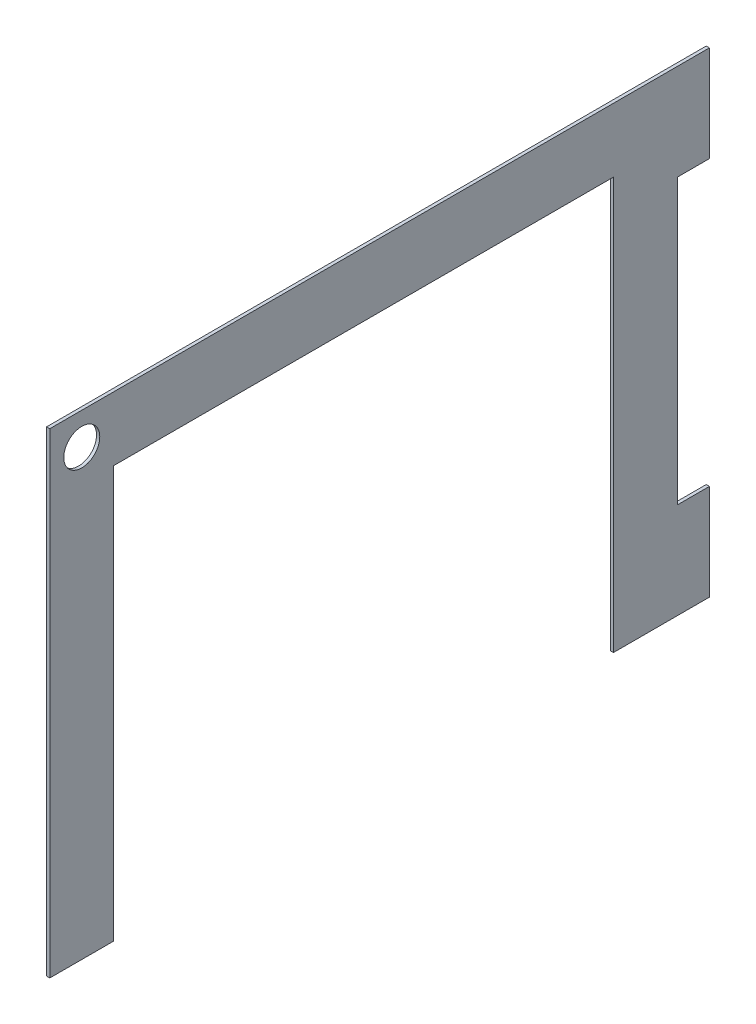
ISO-10303-21;
HEADER;
FILE_DESCRIPTION(('STEP AP214'),'2;1');
FILE_NAME('part.step','',(''),(''),'','','');
FILE_SCHEMA(('AUTOMOTIVE_DESIGN { 1 0 10303 214 1 1 1 1 }'));
ENDSEC;
DATA;
#1=APPLICATION_CONTEXT('core data for automotive mechanical design processes');
#2=APPLICATION_PROTOCOL_DEFINITION('international standard','automotive_design',2000,#1);
#3=PRODUCT_CONTEXT('',#1,'mechanical');
#4=PRODUCT('Part','Part','',(#3));
#5=PRODUCT_RELATED_PRODUCT_CATEGORY('part','',(#4));
#6=PRODUCT_DEFINITION_FORMATION('','',#4);
#7=PRODUCT_DEFINITION_CONTEXT('part definition',#1,'design');
#8=PRODUCT_DEFINITION('design','',#6,#7);
#9=PRODUCT_DEFINITION_SHAPE('','',#8);
#10=(LENGTH_UNIT() NAMED_UNIT(*) SI_UNIT(.MILLI.,.METRE.));
#11=(NAMED_UNIT(*) PLANE_ANGLE_UNIT() SI_UNIT($,.RADIAN.));
#12=(NAMED_UNIT(*) SI_UNIT($,.STERADIAN.) SOLID_ANGLE_UNIT());
#13=UNCERTAINTY_MEASURE_WITH_UNIT(LENGTH_MEASURE(1.E-05),#10,'distance_accuracy_value','');
#14=(GEOMETRIC_REPRESENTATION_CONTEXT(3) GLOBAL_UNCERTAINTY_ASSIGNED_CONTEXT((#13)) GLOBAL_UNIT_ASSIGNED_CONTEXT((#10,
#11,#12)) REPRESENTATION_CONTEXT('',''));
#15=CARTESIAN_POINT('',(0.,0.,0.));
#16=DIRECTION('',(0.,0.,1.));
#17=DIRECTION('',(1.,0.,0.));
#18=AXIS2_PLACEMENT_3D('',#15,#16,#17);
#19=CARTESIAN_POINT('',(1.27,0.,0.));
#20=DIRECTION('',(-1.,0.,0.));
#21=DIRECTION('',(0.,0.,1.));
#22=AXIS2_PLACEMENT_3D('',#19,#20,#21);
#23=PLANE('',#22);
#24=DIRECTION('',(0.,0.,-1.));
#25=VECTOR('',#24,1.);
#26=CARTESIAN_POINT('',(1.27,-254.,-297.346438746439));
#27=LINE('',#26,#25);
#28=CARTESIAN_POINT('',(1.27,-254.,-246.546438746439));
#29=VERTEX_POINT('',#28);
#30=CARTESIAN_POINT('',(1.27,-254.,-322.746438746439));
#31=VERTEX_POINT('',#30);
#32=EDGE_CURVE('E50',#29,#31,#27,.T.);
#33=ORIENTED_EDGE('',*,*,#32,.T.);
#34=DIRECTION('',(0.,1.,0.));
#35=VECTOR('',#34,1.);
#36=CARTESIAN_POINT('',(1.27,-177.8,-322.746438746439));
#37=LINE('',#36,#35);
#38=CARTESIAN_POINT('',(1.27,-177.8,-322.746438746439));
#39=VERTEX_POINT('',#38);
#40=EDGE_CURVE('E106',#31,#39,#37,.T.);
#41=ORIENTED_EDGE('',*,*,#40,.T.);
#42=DIRECTION('',(0.,0.,1.));
#43=VECTOR('',#42,1.);
#44=CARTESIAN_POINT('',(1.27,-177.8,-322.746438746439));
#45=LINE('',#44,#43);
#46=CARTESIAN_POINT('',(1.27,-177.8,-297.346438746439));
#47=VERTEX_POINT('',#46);
#48=EDGE_CURVE('E207',#39,#47,#45,.T.);
#49=ORIENTED_EDGE('',*,*,#48,.T.);
#50=DIRECTION('',(0.,1.,0.));
#51=VECTOR('',#50,1.);
#52=CARTESIAN_POINT('',(1.27,47.625,-297.346438746439));
#53=LINE('',#52,#51);
#54=CARTESIAN_POINT('',(1.27,47.625,-297.346438746439));
#55=VERTEX_POINT('',#54);
#56=EDGE_CURVE('E227',#47,#55,#53,.T.);
#57=ORIENTED_EDGE('',*,*,#56,.T.);
#58=DIRECTION('',(0.,0.,-1.));
#59=VECTOR('',#58,1.);
#60=CARTESIAN_POINT('',(1.27,47.625,-322.746438746439));
#61=LINE('',#60,#59);
#62=CARTESIAN_POINT('',(1.27,47.625,-322.746438746439));
#63=VERTEX_POINT('',#62);
#64=EDGE_CURVE('E224',#55,#63,#61,.T.);
#65=ORIENTED_EDGE('',*,*,#64,.T.);
#66=DIRECTION('',(0.,1.,0.));
#67=VECTOR('',#66,1.);
#68=CARTESIAN_POINT('',(1.27,123.825,-322.746438746439));
#69=LINE('',#68,#67);
#70=CARTESIAN_POINT('',(1.27,123.825,-322.746438746439));
#71=VERTEX_POINT('',#70);
#72=EDGE_CURVE('E226',#63,#71,#69,.T.);
#73=ORIENTED_EDGE('',*,*,#72,.T.);
#74=DIRECTION('',(0.,0.,1.));
#75=VECTOR('',#74,1.);
#76=CARTESIAN_POINT('',(1.27,123.825,-297.346438746439));
#77=LINE('',#76,#75);
#78=CARTESIAN_POINT('',(1.27,123.825,201.134911253561));
#79=VERTEX_POINT('',#78);
#80=EDGE_CURVE('E229',#71,#79,#77,.T.);
#81=ORIENTED_EDGE('',*,*,#80,.T.);
#82=DIRECTION('',(0.,-1.,0.));
#83=VECTOR('',#82,1.);
#84=CARTESIAN_POINT('',(1.27,-254.,201.134911253561));
#85=LINE('',#84,#83);
#86=CARTESIAN_POINT('',(1.27,-254.,201.134911253561));
#87=VERTEX_POINT('',#86);
#88=EDGE_CURVE('E235',#79,#87,#85,.T.);
#89=ORIENTED_EDGE('',*,*,#88,.T.);
#90=DIRECTION('',(0.,0.,-1.));
#91=VECTOR('',#90,1.);
#92=CARTESIAN_POINT('',(1.27,-254.,150.334911253561));
#93=LINE('',#92,#91);
#94=CARTESIAN_POINT('',(1.27,-254.,150.334911253561));
#95=VERTEX_POINT('',#94);
#96=EDGE_CURVE('E138',#87,#95,#93,.T.);
#97=ORIENTED_EDGE('',*,*,#96,.T.);
#98=DIRECTION('',(0.,1.,0.));
#99=VECTOR('',#98,1.);
#100=CARTESIAN_POINT('',(1.27,73.0249999999999,150.334911253561));
#101=LINE('',#100,#99);
#102=CARTESIAN_POINT('',(1.27,73.0249999999999,150.334911253561));
#103=VERTEX_POINT('',#102);
#104=EDGE_CURVE('E132',#95,#103,#101,.T.);
#105=ORIENTED_EDGE('',*,*,#104,.T.);
#106=DIRECTION('',(0.,0.,-1.));
#107=VECTOR('',#106,1.);
#108=CARTESIAN_POINT('',(1.27,73.025,-246.546438746439));
#109=LINE('',#108,#107);
#110=CARTESIAN_POINT('',(1.27,73.025,-246.546438746439));
#111=VERTEX_POINT('',#110);
#112=EDGE_CURVE('E136',#103,#111,#109,.T.);
#113=ORIENTED_EDGE('',*,*,#112,.T.);
#114=DIRECTION('',(0.,-1.,0.));
#115=VECTOR('',#114,1.);
#116=CARTESIAN_POINT('',(1.27,-254.,-246.546438746439));
#117=LINE('',#116,#115);
#118=EDGE_CURVE('E152',#111,#29,#117,.T.);
#119=ORIENTED_EDGE('',*,*,#118,.T.);
#120=EDGE_LOOP('',(#33,#41,#49,#57,#65,#73,#81,#89,#97,#105,#113,#119));
#121=FACE_BOUND('',#120,.T.);
#122=CARTESIAN_POINT('',(1.27,98.425,175.734911253561));
#123=DIRECTION('',(1.,0.,0.));
#124=DIRECTION('',(0.,0.,-1.));
#125=AXIS2_PLACEMENT_3D('',#122,#123,#124);
#126=CIRCLE('',#125,14.2875);
#127=CARTESIAN_POINT('',(1.27,98.425,161.447411253561));
#128=VERTEX_POINT('',#127);
#129=EDGE_CURVE('E161',#128,#128,#126,.T.);
#130=ORIENTED_EDGE('',*,*,#129,.F.);
#131=EDGE_LOOP('',(#130));
#132=FACE_BOUND('',#131,.T.);
#133=ADVANCED_FACE('F33',(#121,#132),#23,.F.);
#134=CARTESIAN_POINT('',(-1.27,0.,0.));
#135=DIRECTION('',(-1.,0.,0.));
#136=DIRECTION('',(0.,0.,1.));
#137=AXIS2_PLACEMENT_3D('',#134,#135,#136);
#138=PLANE('',#137);
#139=DIRECTION('',(0.,1.,0.));
#140=VECTOR('',#139,1.);
#141=CARTESIAN_POINT('',(-1.27,-177.8,-322.746438746439));
#142=LINE('',#141,#140);
#143=CARTESIAN_POINT('',(-1.27,-254.,-322.746438746439));
#144=VERTEX_POINT('',#143);
#145=CARTESIAN_POINT('',(-1.27,-177.8,-322.746438746439));
#146=VERTEX_POINT('',#145);
#147=EDGE_CURVE('E158',#144,#146,#142,.T.);
#148=ORIENTED_EDGE('',*,*,#147,.F.);
#149=DIRECTION('',(0.,0.,-1.));
#150=VECTOR('',#149,1.);
#151=CARTESIAN_POINT('',(-1.27,-254.,-297.346438746439));
#152=LINE('',#151,#150);
#153=CARTESIAN_POINT('',(-1.27,-254.,-246.546438746439));
#154=VERTEX_POINT('',#153);
#155=EDGE_CURVE('E179',#154,#144,#152,.T.);
#156=ORIENTED_EDGE('',*,*,#155,.F.);
#157=DIRECTION('',(0.,-1.,0.));
#158=VECTOR('',#157,1.);
#159=CARTESIAN_POINT('',(-1.27,-254.,-246.546438746439));
#160=LINE('',#159,#158);
#161=CARTESIAN_POINT('',(-1.27,73.025,-246.546438746439));
#162=VERTEX_POINT('',#161);
#163=EDGE_CURVE('E99',#162,#154,#160,.T.);
#164=ORIENTED_EDGE('',*,*,#163,.F.);
#165=DIRECTION('',(0.,0.,-1.));
#166=VECTOR('',#165,1.);
#167=CARTESIAN_POINT('',(-1.27,73.025,-246.546438746439));
#168=LINE('',#167,#166);
#169=CARTESIAN_POINT('',(-1.27,73.0249999999999,150.334911253561));
#170=VERTEX_POINT('',#169);
#171=EDGE_CURVE('E92',#170,#162,#168,.T.);
#172=ORIENTED_EDGE('',*,*,#171,.F.);
#173=DIRECTION('',(0.,1.,0.));
#174=VECTOR('',#173,1.);
#175=CARTESIAN_POINT('',(-1.27,73.0249999999999,150.334911253561));
#176=LINE('',#175,#174);
#177=CARTESIAN_POINT('',(-1.27,-254.,150.334911253561));
#178=VERTEX_POINT('',#177);
#179=EDGE_CURVE('E146',#178,#170,#176,.T.);
#180=ORIENTED_EDGE('',*,*,#179,.F.);
#181=DIRECTION('',(0.,0.,-1.));
#182=VECTOR('',#181,1.);
#183=CARTESIAN_POINT('',(-1.27,-254.,150.334911253561));
#184=LINE('',#183,#182);
#185=CARTESIAN_POINT('',(-1.27,-254.,201.134911253561));
#186=VERTEX_POINT('',#185);
#187=EDGE_CURVE('E174',#186,#178,#184,.T.);
#188=ORIENTED_EDGE('',*,*,#187,.F.);
#189=DIRECTION('',(0.,-1.,0.));
#190=VECTOR('',#189,1.);
#191=CARTESIAN_POINT('',(-1.27,-254.,201.134911253561));
#192=LINE('',#191,#190);
#193=CARTESIAN_POINT('',(-1.27,123.825,201.134911253561));
#194=VERTEX_POINT('',#193);
#195=EDGE_CURVE('E172',#194,#186,#192,.T.);
#196=ORIENTED_EDGE('',*,*,#195,.F.);
#197=DIRECTION('',(0.,0.,1.));
#198=VECTOR('',#197,1.);
#199=CARTESIAN_POINT('',(-1.27,123.825,201.134911253561));
#200=LINE('',#199,#198);
#201=CARTESIAN_POINT('',(-1.27,123.825,-322.746438746439));
#202=VERTEX_POINT('',#201);
#203=EDGE_CURVE('E170',#202,#194,#200,.T.);
#204=ORIENTED_EDGE('',*,*,#203,.F.);
#205=DIRECTION('',(0.,1.,0.));
#206=VECTOR('',#205,1.);
#207=CARTESIAN_POINT('',(-1.27,123.825,-322.746438746439));
#208=LINE('',#207,#206);
#209=CARTESIAN_POINT('',(-1.27,47.625,-322.746438746439));
#210=VERTEX_POINT('',#209);
#211=EDGE_CURVE('E167',#210,#202,#208,.T.);
#212=ORIENTED_EDGE('',*,*,#211,.F.);
#213=DIRECTION('',(0.,0.,-1.));
#214=VECTOR('',#213,1.);
#215=CARTESIAN_POINT('',(-1.27,47.625,-322.746438746439));
#216=LINE('',#215,#214);
#217=CARTESIAN_POINT('',(-1.27,47.625,-297.346438746439));
#218=VERTEX_POINT('',#217);
#219=EDGE_CURVE('E165',#218,#210,#216,.T.);
#220=ORIENTED_EDGE('',*,*,#219,.F.);
#221=DIRECTION('',(0.,1.,0.));
#222=VECTOR('',#221,1.);
#223=CARTESIAN_POINT('',(-1.27,47.625,-297.346438746439));
#224=LINE('',#223,#222);
#225=CARTESIAN_POINT('',(-1.27,-177.8,-297.346438746439));
#226=VERTEX_POINT('',#225);
#227=EDGE_CURVE('E163',#226,#218,#224,.T.);
#228=ORIENTED_EDGE('',*,*,#227,.F.);
#229=DIRECTION('',(0.,0.,1.));
#230=VECTOR('',#229,1.);
#231=CARTESIAN_POINT('',(-1.27,-177.8,-322.746438746439));
#232=LINE('',#231,#230);
#233=EDGE_CURVE('E160',#146,#226,#232,.T.);
#234=ORIENTED_EDGE('',*,*,#233,.F.);
#235=EDGE_LOOP('',(#148,#156,#164,#172,#180,#188,#196,#204,#212,#220,#228,#234));
#236=FACE_BOUND('',#235,.T.);
#237=CARTESIAN_POINT('',(-1.27,98.425,175.734911253561));
#238=DIRECTION('',(1.,0.,0.));
#239=DIRECTION('',(0.,0.,-1.));
#240=AXIS2_PLACEMENT_3D('',#237,#238,#239);
#241=CIRCLE('',#240,14.2875);
#242=CARTESIAN_POINT('',(-1.27,98.425,161.447411253561));
#243=VERTEX_POINT('',#242);
#244=EDGE_CURVE('E251',#243,#243,#241,.T.);
#245=ORIENTED_EDGE('',*,*,#244,.T.);
#246=EDGE_LOOP('',(#245));
#247=FACE_BOUND('',#246,.T.);
#248=ADVANCED_FACE('F211',(#236,#247),#138,.T.);
#249=CARTESIAN_POINT('',(1.27,-177.8,-322.746438746439));
#250=DIRECTION('',(0.,0.,1.));
#251=DIRECTION('',(1.,0.,0.));
#252=AXIS2_PLACEMENT_3D('',#249,#250,#251);
#253=PLANE('',#252);
#254=ORIENTED_EDGE('',*,*,#147,.T.);
#255=DIRECTION('',(-1.,0.,0.));
#256=VECTOR('',#255,1.);
#257=CARTESIAN_POINT('',(1.27,-177.8,-322.746438746439));
#258=LINE('',#257,#256);
#259=EDGE_CURVE('E42',#39,#146,#258,.T.);
#260=ORIENTED_EDGE('',*,*,#259,.F.);
#261=ORIENTED_EDGE('',*,*,#40,.F.);
#262=DIRECTION('',(-1.,0.,0.));
#263=VECTOR('',#262,1.);
#264=CARTESIAN_POINT('',(1.27,-254.,-322.746438746439));
#265=LINE('',#264,#263);
#266=EDGE_CURVE('E11',#31,#144,#265,.T.);
#267=ORIENTED_EDGE('',*,*,#266,.T.);
#268=EDGE_LOOP('',(#254,#260,#261,#267));
#269=FACE_BOUND('',#268,.T.);
#270=ADVANCED_FACE('F35',(#269),#253,.F.);
#271=CARTESIAN_POINT('',(1.27,-177.8,-322.746438746439));
#272=DIRECTION('',(0.,-1.,0.));
#273=DIRECTION('',(0.,0.,-1.));
#274=AXIS2_PLACEMENT_3D('',#271,#272,#273);
#275=PLANE('',#274);
#276=ORIENTED_EDGE('',*,*,#233,.T.);
#277=DIRECTION('',(-1.,0.,0.));
#278=VECTOR('',#277,1.);
#279=CARTESIAN_POINT('',(1.27,-177.8,-297.346438746439));
#280=LINE('',#279,#278);
#281=EDGE_CURVE('E199',#47,#226,#280,.T.);
#282=ORIENTED_EDGE('',*,*,#281,.F.);
#283=ORIENTED_EDGE('',*,*,#48,.F.);
#284=ORIENTED_EDGE('',*,*,#259,.T.);
#285=EDGE_LOOP('',(#276,#282,#283,#284));
#286=FACE_BOUND('',#285,.T.);
#287=ADVANCED_FACE('F205',(#286),#275,.F.);
#288=CARTESIAN_POINT('',(1.27,47.625,-297.346438746439));
#289=DIRECTION('',(0.,0.,1.));
#290=DIRECTION('',(0.,-1.,0.));
#291=AXIS2_PLACEMENT_3D('',#288,#289,#290);
#292=PLANE('',#291);
#293=ORIENTED_EDGE('',*,*,#227,.T.);
#294=DIRECTION('',(-1.,0.,0.));
#295=VECTOR('',#294,1.);
#296=CARTESIAN_POINT('',(1.27,47.625,-297.346438746439));
#297=LINE('',#296,#295);
#298=EDGE_CURVE('E196',#55,#218,#297,.T.);
#299=ORIENTED_EDGE('',*,*,#298,.F.);
#300=ORIENTED_EDGE('',*,*,#56,.F.);
#301=ORIENTED_EDGE('',*,*,#281,.T.);
#302=EDGE_LOOP('',(#293,#299,#300,#301));
#303=FACE_BOUND('',#302,.T.);
#304=ADVANCED_FACE('F218',(#303),#292,.F.);
#305=CARTESIAN_POINT('',(1.27,47.625,-322.746438746439));
#306=DIRECTION('',(0.,1.,0.));
#307=DIRECTION('',(0.,0.,1.));
#308=AXIS2_PLACEMENT_3D('',#305,#306,#307);
#309=PLANE('',#308);
#310=ORIENTED_EDGE('',*,*,#219,.T.);
#311=DIRECTION('',(-1.,0.,0.));
#312=VECTOR('',#311,1.);
#313=CARTESIAN_POINT('',(1.27,47.625,-322.746438746439));
#314=LINE('',#313,#312);
#315=EDGE_CURVE('E193',#63,#210,#314,.T.);
#316=ORIENTED_EDGE('',*,*,#315,.F.);
#317=ORIENTED_EDGE('',*,*,#64,.F.);
#318=ORIENTED_EDGE('',*,*,#298,.T.);
#319=EDGE_LOOP('',(#310,#316,#317,#318));
#320=FACE_BOUND('',#319,.T.);
#321=ADVANCED_FACE('F222',(#320),#309,.F.);
#322=CARTESIAN_POINT('',(1.27,123.825,-322.746438746439));
#323=DIRECTION('',(0.,0.,1.));
#324=DIRECTION('',(1.,0.,0.));
#325=AXIS2_PLACEMENT_3D('',#322,#323,#324);
#326=PLANE('',#325);
#327=ORIENTED_EDGE('',*,*,#211,.T.);
#328=DIRECTION('',(-1.,0.,0.));
#329=VECTOR('',#328,1.);
#330=CARTESIAN_POINT('',(1.27,123.825,-322.746438746439));
#331=LINE('',#330,#329);
#332=EDGE_CURVE('E190',#71,#202,#331,.T.);
#333=ORIENTED_EDGE('',*,*,#332,.F.);
#334=ORIENTED_EDGE('',*,*,#72,.F.);
#335=ORIENTED_EDGE('',*,*,#315,.T.);
#336=EDGE_LOOP('',(#327,#333,#334,#335));
#337=FACE_BOUND('',#336,.T.);
#338=ADVANCED_FACE('F282',(#337),#326,.F.);
#339=CARTESIAN_POINT('',(1.27,123.825,201.134911253561));
#340=DIRECTION('',(0.,-1.,0.));
#341=DIRECTION('',(0.,0.,-1.));
#342=AXIS2_PLACEMENT_3D('',#339,#340,#341);
#343=PLANE('',#342);
#344=ORIENTED_EDGE('',*,*,#203,.T.);
#345=DIRECTION('',(-1.,0.,0.));
#346=VECTOR('',#345,1.);
#347=CARTESIAN_POINT('',(1.27,123.825,201.134911253561));
#348=LINE('',#347,#346);
#349=EDGE_CURVE('E187',#79,#194,#348,.T.);
#350=ORIENTED_EDGE('',*,*,#349,.F.);
#351=ORIENTED_EDGE('',*,*,#80,.F.);
#352=ORIENTED_EDGE('',*,*,#332,.T.);
#353=EDGE_LOOP('',(#344,#350,#351,#352));
#354=FACE_BOUND('',#353,.T.);
#355=ADVANCED_FACE('F279',(#354),#343,.F.);
#356=CARTESIAN_POINT('',(1.27,-254.,201.134911253561));
#357=DIRECTION('',(0.,0.,-1.));
#358=DIRECTION('',(0.,1.,0.));
#359=AXIS2_PLACEMENT_3D('',#356,#357,#358);
#360=PLANE('',#359);
#361=ORIENTED_EDGE('',*,*,#195,.T.);
#362=DIRECTION('',(-1.,0.,0.));
#363=VECTOR('',#362,1.);
#364=CARTESIAN_POINT('',(1.27,-254.,201.134911253561));
#365=LINE('',#364,#363);
#366=EDGE_CURVE('E184',#87,#186,#365,.T.);
#367=ORIENTED_EDGE('',*,*,#366,.F.);
#368=ORIENTED_EDGE('',*,*,#88,.F.);
#369=ORIENTED_EDGE('',*,*,#349,.T.);
#370=EDGE_LOOP('',(#361,#367,#368,#369));
#371=FACE_BOUND('',#370,.T.);
#372=ADVANCED_FACE('F241',(#371),#360,.F.);
#373=CARTESIAN_POINT('',(1.27,-254.,150.334911253561));
#374=DIRECTION('',(0.,1.,0.));
#375=DIRECTION('',(0.,0.,1.));
#376=AXIS2_PLACEMENT_3D('',#373,#374,#375);
#377=PLANE('',#376);
#378=ORIENTED_EDGE('',*,*,#187,.T.);
#379=DIRECTION('',(-1.,0.,0.));
#380=VECTOR('',#379,1.);
#381=CARTESIAN_POINT('',(1.27,-254.,150.334911253561));
#382=LINE('',#381,#380);
#383=EDGE_CURVE('E147',#95,#178,#382,.T.);
#384=ORIENTED_EDGE('',*,*,#383,.F.);
#385=ORIENTED_EDGE('',*,*,#96,.F.);
#386=ORIENTED_EDGE('',*,*,#366,.T.);
#387=EDGE_LOOP('',(#378,#384,#385,#386));
#388=FACE_BOUND('',#387,.T.);
#389=ADVANCED_FACE('F245',(#388),#377,.F.);
#390=CARTESIAN_POINT('',(1.27,73.0249999999999,150.334911253561));
#391=DIRECTION('',(0.,0.,1.));
#392=DIRECTION('',(0.,-1.,0.));
#393=AXIS2_PLACEMENT_3D('',#390,#391,#392);
#394=PLANE('',#393);
#395=ORIENTED_EDGE('',*,*,#179,.T.);
#396=DIRECTION('',(-1.,0.,0.));
#397=VECTOR('',#396,1.);
#398=CARTESIAN_POINT('',(1.27,73.0249999999999,150.334911253561));
#399=LINE('',#398,#397);
#400=EDGE_CURVE('E143',#103,#170,#399,.T.);
#401=ORIENTED_EDGE('',*,*,#400,.F.);
#402=ORIENTED_EDGE('',*,*,#104,.F.);
#403=ORIENTED_EDGE('',*,*,#383,.T.);
#404=EDGE_LOOP('',(#395,#401,#402,#403));
#405=FACE_BOUND('',#404,.T.);
#406=ADVANCED_FACE('F144',(#405),#394,.F.);
#407=CARTESIAN_POINT('',(1.27,73.025,-246.546438746439));
#408=DIRECTION('',(0.,1.,0.));
#409=DIRECTION('',(0.,0.,1.));
#410=AXIS2_PLACEMENT_3D('',#407,#408,#409);
#411=PLANE('',#410);
#412=ORIENTED_EDGE('',*,*,#171,.T.);
#413=DIRECTION('',(-1.,0.,0.));
#414=VECTOR('',#413,1.);
#415=CARTESIAN_POINT('',(1.27,73.025,-246.546438746439));
#416=LINE('',#415,#414);
#417=EDGE_CURVE('E148',#111,#162,#416,.T.);
#418=ORIENTED_EDGE('',*,*,#417,.F.);
#419=ORIENTED_EDGE('',*,*,#112,.F.);
#420=ORIENTED_EDGE('',*,*,#400,.T.);
#421=EDGE_LOOP('',(#412,#418,#419,#420));
#422=FACE_BOUND('',#421,.T.);
#423=ADVANCED_FACE('F150',(#422),#411,.F.);
#424=CARTESIAN_POINT('',(1.27,-254.,-246.546438746439));
#425=DIRECTION('',(0.,0.,-1.));
#426=DIRECTION('',(-1.,0.,0.));
#427=AXIS2_PLACEMENT_3D('',#424,#425,#426);
#428=PLANE('',#427);
#429=ORIENTED_EDGE('',*,*,#163,.T.);
#430=DIRECTION('',(-1.,0.,0.));
#431=VECTOR('',#430,1.);
#432=CARTESIAN_POINT('',(1.27,-254.,-246.546438746439));
#433=LINE('',#432,#431);
#434=EDGE_CURVE('E154',#29,#154,#433,.T.);
#435=ORIENTED_EDGE('',*,*,#434,.F.);
#436=ORIENTED_EDGE('',*,*,#118,.F.);
#437=ORIENTED_EDGE('',*,*,#417,.T.);
#438=EDGE_LOOP('',(#429,#435,#436,#437));
#439=FACE_BOUND('',#438,.T.);
#440=ADVANCED_FACE('F247',(#439),#428,.F.);
#441=CARTESIAN_POINT('',(1.27,-254.,-297.346438746439));
#442=DIRECTION('',(0.,1.,0.));
#443=DIRECTION('',(0.,0.,1.));
#444=AXIS2_PLACEMENT_3D('',#441,#442,#443);
#445=PLANE('',#444);
#446=ORIENTED_EDGE('',*,*,#155,.T.);
#447=ORIENTED_EDGE('',*,*,#266,.F.);
#448=ORIENTED_EDGE('',*,*,#32,.F.);
#449=ORIENTED_EDGE('',*,*,#434,.T.);
#450=EDGE_LOOP('',(#446,#447,#448,#449));
#451=FACE_BOUND('',#450,.T.);
#452=ADVANCED_FACE('F246',(#451),#445,.F.);
#453=CARTESIAN_POINT('',(1.27,98.425,175.734911253561));
#454=DIRECTION('',(-1.,0.,0.));
#455=DIRECTION('',(0.,0.,1.));
#456=AXIS2_PLACEMENT_3D('',#453,#454,#455);
#457=CYLINDRICAL_SURFACE('',#456,14.2875);
#458=ORIENTED_EDGE('',*,*,#129,.T.);
#459=EDGE_LOOP('',(#458));
#460=FACE_BOUND('',#459,.T.);
#461=ORIENTED_EDGE('',*,*,#244,.F.);
#462=EDGE_LOOP('',(#461));
#463=FACE_BOUND('',#462,.T.);
#464=ADVANCED_FACE('F257',(#460,#463),#457,.F.);
#465=CLOSED_SHELL('',(#133,#248,#270,#287,#304,#321,#338,#355,#372,#389,#406,#423,#440,#452,#464));
#466=MANIFOLD_SOLID_BREP('B2',#465);
#467=ADVANCED_BREP_SHAPE_REPRESENTATION('',(#18,#466),#14);
#468=SHAPE_DEFINITION_REPRESENTATION(#9,#467);
ENDSEC;
END-ISO-10303-21;
